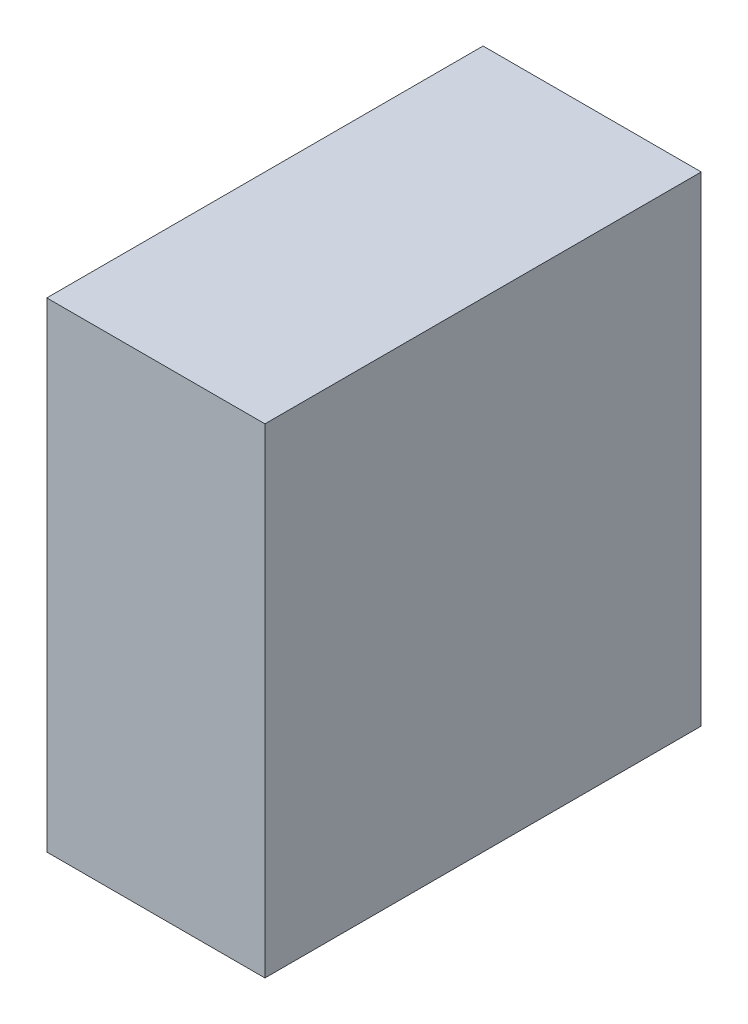
ISO-10303-21;
HEADER;
FILE_DESCRIPTION(('STEP AP214'),'2;1');
FILE_NAME('part.step','',(''),(''),'','','');
FILE_SCHEMA(('AUTOMOTIVE_DESIGN { 1 0 10303 214 1 1 1 1 }'));
ENDSEC;
DATA;
#1=APPLICATION_CONTEXT('core data for automotive mechanical design processes');
#2=APPLICATION_PROTOCOL_DEFINITION('international standard','automotive_design',2000,#1);
#3=PRODUCT_CONTEXT('',#1,'mechanical');
#4=PRODUCT('Part','Part','',(#3));
#5=PRODUCT_RELATED_PRODUCT_CATEGORY('part','',(#4));
#6=PRODUCT_DEFINITION_FORMATION('','',#4);
#7=PRODUCT_DEFINITION_CONTEXT('part definition',#1,'design');
#8=PRODUCT_DEFINITION('design','',#6,#7);
#9=PRODUCT_DEFINITION_SHAPE('','',#8);
#10=(LENGTH_UNIT() NAMED_UNIT(*) SI_UNIT(.MILLI.,.METRE.));
#11=(NAMED_UNIT(*) PLANE_ANGLE_UNIT() SI_UNIT($,.RADIAN.));
#12=(NAMED_UNIT(*) SI_UNIT($,.STERADIAN.) SOLID_ANGLE_UNIT());
#13=UNCERTAINTY_MEASURE_WITH_UNIT(LENGTH_MEASURE(1.E-05),#10,'distance_accuracy_value','');
#14=(GEOMETRIC_REPRESENTATION_CONTEXT(3) GLOBAL_UNCERTAINTY_ASSIGNED_CONTEXT((#13)) GLOBAL_UNIT_ASSIGNED_CONTEXT((#10,
#11,#12)) REPRESENTATION_CONTEXT('',''));
#15=CARTESIAN_POINT('',(0.,0.,0.));
#16=DIRECTION('',(0.,0.,1.));
#17=DIRECTION('',(1.,0.,0.));
#18=AXIS2_PLACEMENT_3D('',#15,#16,#17);
#19=CARTESIAN_POINT('',(0.,11.,0.));
#20=DIRECTION('',(1.,0.,0.));
#21=DIRECTION('',(0.,0.,-1.));
#22=AXIS2_PLACEMENT_3D('',#19,#20,#21);
#23=PLANE('',#22);
#24=DIRECTION('',(0.,0.,1.));
#25=VECTOR('',#24,1.);
#26=CARTESIAN_POINT('',(0.,0.,0.));
#27=LINE('',#26,#25);
#28=CARTESIAN_POINT('',(0.,0.,0.));
#29=VERTEX_POINT('',#28);
#30=CARTESIAN_POINT('',(0.,0.,10.));
#31=VERTEX_POINT('',#30);
#32=EDGE_CURVE('E113',#29,#31,#27,.T.);
#33=ORIENTED_EDGE('',*,*,#32,.T.);
#34=DIRECTION('',(0.,-1.,0.));
#35=VECTOR('',#34,1.);
#36=CARTESIAN_POINT('',(0.,11.,10.));
#37=LINE('',#36,#35);
#38=CARTESIAN_POINT('',(0.,11.,10.));
#39=VERTEX_POINT('',#38);
#40=EDGE_CURVE('E11',#39,#31,#37,.T.);
#41=ORIENTED_EDGE('',*,*,#40,.F.);
#42=DIRECTION('',(0.,0.,1.));
#43=VECTOR('',#42,1.);
#44=CARTESIAN_POINT('',(0.,11.,0.));
#45=LINE('',#44,#43);
#46=CARTESIAN_POINT('',(0.,11.,0.));
#47=VERTEX_POINT('',#46);
#48=EDGE_CURVE('E97',#47,#39,#45,.T.);
#49=ORIENTED_EDGE('',*,*,#48,.F.);
#50=DIRECTION('',(0.,-1.,0.));
#51=VECTOR('',#50,1.);
#52=CARTESIAN_POINT('',(0.,11.,0.));
#53=LINE('',#52,#51);
#54=EDGE_CURVE('E109',#47,#29,#53,.T.);
#55=ORIENTED_EDGE('',*,*,#54,.T.);
#56=EDGE_LOOP('',(#33,#41,#49,#55));
#57=FACE_BOUND('',#56,.T.);
#58=ADVANCED_FACE('F45',(#57),#23,.F.);
#59=CARTESIAN_POINT('',(0.,11.,10.));
#60=DIRECTION('',(0.,0.,-1.));
#61=DIRECTION('',(-1.,0.,0.));
#62=AXIS2_PLACEMENT_3D('',#59,#60,#61);
#63=PLANE('',#62);
#64=DIRECTION('',(1.,0.,0.));
#65=VECTOR('',#64,1.);
#66=CARTESIAN_POINT('',(0.,0.,10.));
#67=LINE('',#66,#65);
#68=CARTESIAN_POINT('',(5.,0.,10.));
#69=VERTEX_POINT('',#68);
#70=EDGE_CURVE('E102',#31,#69,#67,.T.);
#71=ORIENTED_EDGE('',*,*,#70,.T.);
#72=DIRECTION('',(0.,-1.,0.));
#73=VECTOR('',#72,1.);
#74=CARTESIAN_POINT('',(5.,11.,10.));
#75=LINE('',#74,#73);
#76=CARTESIAN_POINT('',(5.,11.,10.));
#77=VERTEX_POINT('',#76);
#78=EDGE_CURVE('E54',#77,#69,#75,.T.);
#79=ORIENTED_EDGE('',*,*,#78,.F.);
#80=DIRECTION('',(1.,0.,0.));
#81=VECTOR('',#80,1.);
#82=CARTESIAN_POINT('',(0.,11.,10.));
#83=LINE('',#82,#81);
#84=EDGE_CURVE('E92',#39,#77,#83,.T.);
#85=ORIENTED_EDGE('',*,*,#84,.F.);
#86=ORIENTED_EDGE('',*,*,#40,.T.);
#87=EDGE_LOOP('',(#71,#79,#85,#86));
#88=FACE_BOUND('',#87,.T.);
#89=ADVANCED_FACE('F101',(#88),#63,.F.);
#90=CARTESIAN_POINT('',(5.,11.,0.));
#91=DIRECTION('',(-1.,0.,0.));
#92=DIRECTION('',(0.,0.,1.));
#93=AXIS2_PLACEMENT_3D('',#90,#91,#92);
#94=PLANE('',#93);
#95=DIRECTION('',(0.,0.,-1.));
#96=VECTOR('',#95,1.);
#97=CARTESIAN_POINT('',(5.,0.,0.));
#98=LINE('',#97,#96);
#99=CARTESIAN_POINT('',(5.,0.,0.));
#100=VERTEX_POINT('',#99);
#101=EDGE_CURVE('E79',#69,#100,#98,.T.);
#102=ORIENTED_EDGE('',*,*,#101,.T.);
#103=DIRECTION('',(0.,-1.,0.));
#104=VECTOR('',#103,1.);
#105=CARTESIAN_POINT('',(5.,11.,0.));
#106=LINE('',#105,#104);
#107=CARTESIAN_POINT('',(5.,11.,0.));
#108=VERTEX_POINT('',#107);
#109=EDGE_CURVE('E104',#108,#100,#106,.T.);
#110=ORIENTED_EDGE('',*,*,#109,.F.);
#111=DIRECTION('',(0.,0.,-1.));
#112=VECTOR('',#111,1.);
#113=CARTESIAN_POINT('',(5.,11.,0.));
#114=LINE('',#113,#112);
#115=EDGE_CURVE('E95',#77,#108,#114,.T.);
#116=ORIENTED_EDGE('',*,*,#115,.F.);
#117=ORIENTED_EDGE('',*,*,#78,.T.);
#118=EDGE_LOOP('',(#102,#110,#116,#117));
#119=FACE_BOUND('',#118,.T.);
#120=ADVANCED_FACE('F105',(#119),#94,.F.);
#121=CARTESIAN_POINT('',(0.,11.,0.));
#122=DIRECTION('',(0.,0.,1.));
#123=DIRECTION('',(1.,0.,0.));
#124=AXIS2_PLACEMENT_3D('',#121,#122,#123);
#125=PLANE('',#124);
#126=DIRECTION('',(-1.,0.,0.));
#127=VECTOR('',#126,1.);
#128=CARTESIAN_POINT('',(0.,0.,0.));
#129=LINE('',#128,#127);
#130=EDGE_CURVE('E85',#100,#29,#129,.T.);
#131=ORIENTED_EDGE('',*,*,#130,.T.);
#132=ORIENTED_EDGE('',*,*,#54,.F.);
#133=DIRECTION('',(-1.,0.,0.));
#134=VECTOR('',#133,1.);
#135=CARTESIAN_POINT('',(0.,11.,0.));
#136=LINE('',#135,#134);
#137=EDGE_CURVE('E62',#108,#47,#136,.T.);
#138=ORIENTED_EDGE('',*,*,#137,.F.);
#139=ORIENTED_EDGE('',*,*,#109,.T.);
#140=EDGE_LOOP('',(#131,#132,#138,#139));
#141=FACE_BOUND('',#140,.T.);
#142=ADVANCED_FACE('F126',(#141),#125,.F.);
#143=CARTESIAN_POINT('',(0.,11.,0.));
#144=DIRECTION('',(0.,1.,0.));
#145=DIRECTION('',(0.,0.,1.));
#146=AXIS2_PLACEMENT_3D('',#143,#144,#145);
#147=PLANE('',#146);
#148=ORIENTED_EDGE('',*,*,#48,.T.);
#149=ORIENTED_EDGE('',*,*,#84,.T.);
#150=ORIENTED_EDGE('',*,*,#115,.T.);
#151=ORIENTED_EDGE('',*,*,#137,.T.);
#152=EDGE_LOOP('',(#148,#149,#150,#151));
#153=FACE_BOUND('',#152,.T.);
#154=ADVANCED_FACE('F93',(#153),#147,.T.);
#155=CARTESIAN_POINT('',(0.,0.,0.));
#156=DIRECTION('',(0.,1.,0.));
#157=DIRECTION('',(0.,0.,1.));
#158=AXIS2_PLACEMENT_3D('',#155,#156,#157);
#159=PLANE('',#158);
#160=ORIENTED_EDGE('',*,*,#32,.F.);
#161=ORIENTED_EDGE('',*,*,#130,.F.);
#162=ORIENTED_EDGE('',*,*,#101,.F.);
#163=ORIENTED_EDGE('',*,*,#70,.F.);
#164=EDGE_LOOP('',(#160,#161,#162,#163));
#165=FACE_BOUND('',#164,.T.);
#166=ADVANCED_FACE('F129',(#165),#159,.F.);
#167=CLOSED_SHELL('',(#58,#89,#120,#142,#154,#166));
#168=MANIFOLD_SOLID_BREP('B2',#167);
#169=ADVANCED_BREP_SHAPE_REPRESENTATION('',(#18,#168),#14);
#170=SHAPE_DEFINITION_REPRESENTATION(#9,#169);
ENDSEC;
END-ISO-10303-21;
